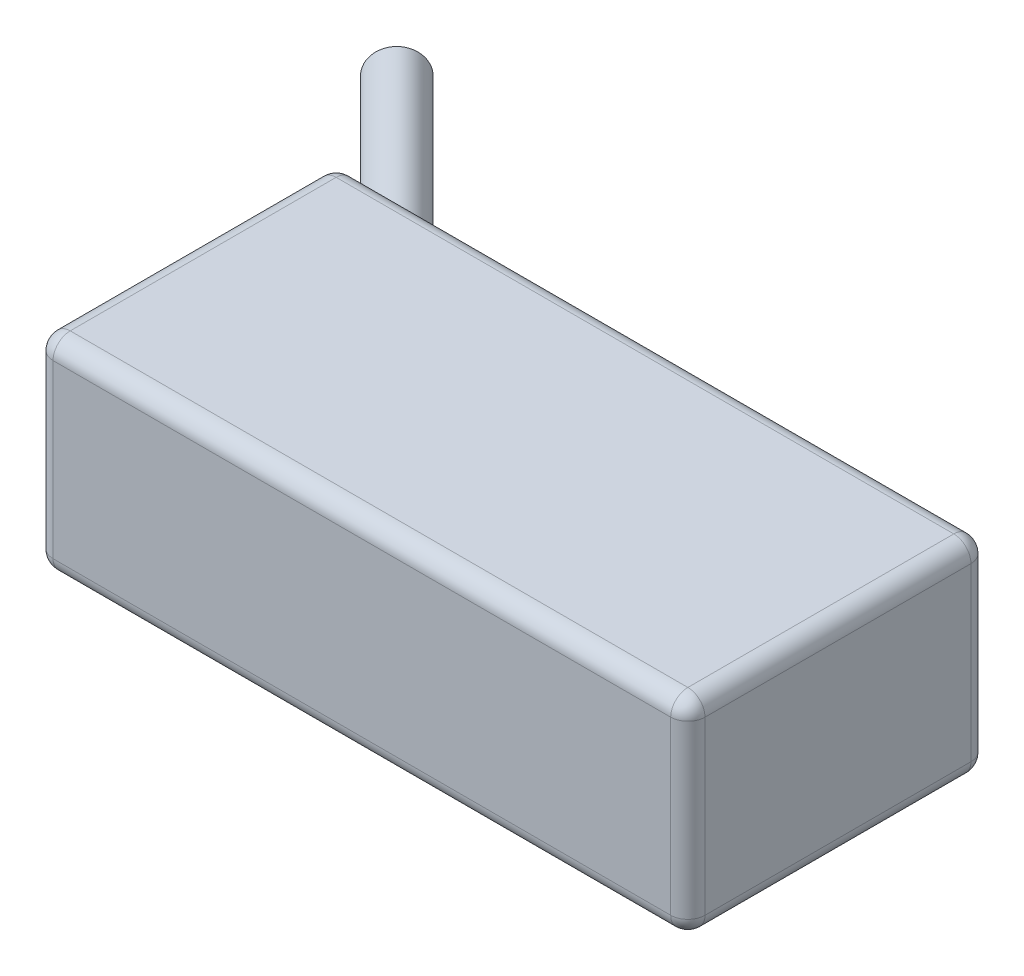
ISO-10303-21;
HEADER;
FILE_DESCRIPTION(('STEP AP214'),'2;1');
FILE_NAME('part.step','',(''),(''),'','','');
FILE_SCHEMA(('AUTOMOTIVE_DESIGN { 1 0 10303 214 1 1 1 1 }'));
ENDSEC;
DATA;
#1=APPLICATION_CONTEXT('core data for automotive mechanical design processes');
#2=APPLICATION_PROTOCOL_DEFINITION('international standard','automotive_design',2000,#1);
#3=PRODUCT_CONTEXT('',#1,'mechanical');
#4=PRODUCT('Part','Part','',(#3));
#5=PRODUCT_RELATED_PRODUCT_CATEGORY('part','',(#4));
#6=PRODUCT_DEFINITION_FORMATION('','',#4);
#7=PRODUCT_DEFINITION_CONTEXT('part definition',#1,'design');
#8=PRODUCT_DEFINITION('design','',#6,#7);
#9=PRODUCT_DEFINITION_SHAPE('','',#8);
#10=(LENGTH_UNIT() NAMED_UNIT(*) SI_UNIT(.MILLI.,.METRE.));
#11=(NAMED_UNIT(*) PLANE_ANGLE_UNIT() SI_UNIT($,.RADIAN.));
#12=(NAMED_UNIT(*) SI_UNIT($,.STERADIAN.) SOLID_ANGLE_UNIT());
#13=UNCERTAINTY_MEASURE_WITH_UNIT(LENGTH_MEASURE(1.E-05),#10,'distance_accuracy_value','');
#14=(GEOMETRIC_REPRESENTATION_CONTEXT(3) GLOBAL_UNCERTAINTY_ASSIGNED_CONTEXT((#13)) GLOBAL_UNIT_ASSIGNED_CONTEXT((#10,
#11,#12)) REPRESENTATION_CONTEXT('',''));
#15=CARTESIAN_POINT('',(0.,0.,0.));
#16=DIRECTION('',(0.,0.,1.));
#17=DIRECTION('',(1.,0.,0.));
#18=AXIS2_PLACEMENT_3D('',#15,#16,#17);
#19=CARTESIAN_POINT('',(38.,12.,-17.5));
#20=DIRECTION('',(-1.,0.,0.));
#21=DIRECTION('',(0.,0.,1.));
#22=AXIS2_PLACEMENT_3D('',#19,#20,#21);
#23=PLANE('',#22);
#24=DIRECTION('',(0.,-1.,0.));
#25=VECTOR('',#24,1.);
#26=CARTESIAN_POINT('',(38.,12.,15.5));
#27=LINE('',#26,#25);
#28=CARTESIAN_POINT('',(38.,10.,15.5));
#29=VERTEX_POINT('',#28);
#30=CARTESIAN_POINT('',(38.,-10.,15.5));
#31=VERTEX_POINT('',#30);
#32=EDGE_CURVE('E168',#29,#31,#27,.T.);
#33=ORIENTED_EDGE('',*,*,#32,.T.);
#34=DIRECTION('',(0.,0.,-1.));
#35=VECTOR('',#34,1.);
#36=CARTESIAN_POINT('',(38.,-10.,-17.5));
#37=LINE('',#36,#35);
#38=CARTESIAN_POINT('',(38.,-10.,-15.5));
#39=VERTEX_POINT('',#38);
#40=EDGE_CURVE('E173',#31,#39,#37,.T.);
#41=ORIENTED_EDGE('',*,*,#40,.T.);
#42=DIRECTION('',(0.,-1.,0.));
#43=VECTOR('',#42,1.);
#44=CARTESIAN_POINT('',(38.,12.,-15.5));
#45=LINE('',#44,#43);
#46=CARTESIAN_POINT('',(38.,10.,-15.5));
#47=VERTEX_POINT('',#46);
#48=EDGE_CURVE('E170',#39,#47,#45,.F.);
#49=ORIENTED_EDGE('',*,*,#48,.T.);
#50=DIRECTION('',(0.,0.,-1.));
#51=VECTOR('',#50,1.);
#52=CARTESIAN_POINT('',(38.,10.,17.5));
#53=LINE('',#52,#51);
#54=EDGE_CURVE('E166',#47,#29,#53,.F.);
#55=ORIENTED_EDGE('',*,*,#54,.T.);
#56=EDGE_LOOP('',(#33,#41,#49,#55));
#57=FACE_BOUND('',#56,.T.);
#58=ADVANCED_FACE('F39',(#57),#23,.F.);
#59=CARTESIAN_POINT('',(-38.,12.,-17.5));
#60=DIRECTION('',(0.,0.,1.));
#61=DIRECTION('',(1.,0.,0.));
#62=AXIS2_PLACEMENT_3D('',#59,#60,#61);
#63=PLANE('',#62);
#64=DIRECTION('',(0.,-1.,0.));
#65=VECTOR('',#64,1.);
#66=CARTESIAN_POINT('',(36.,12.,-17.5));
#67=LINE('',#66,#65);
#68=CARTESIAN_POINT('',(36.,10.,-17.5));
#69=VERTEX_POINT('',#68);
#70=CARTESIAN_POINT('',(36.,-10.,-17.5));
#71=VERTEX_POINT('',#70);
#72=EDGE_CURVE('E161',#69,#71,#67,.T.);
#73=ORIENTED_EDGE('',*,*,#72,.T.);
#74=DIRECTION('',(-1.,0.,0.));
#75=VECTOR('',#74,1.);
#76=CARTESIAN_POINT('',(-38.,-10.,-17.5));
#77=LINE('',#76,#75);
#78=CARTESIAN_POINT('',(-36.,-10.,-17.5));
#79=VERTEX_POINT('',#78);
#80=EDGE_CURVE('E164',#71,#79,#77,.T.);
#81=ORIENTED_EDGE('',*,*,#80,.T.);
#82=DIRECTION('',(0.,-1.,0.));
#83=VECTOR('',#82,1.);
#84=CARTESIAN_POINT('',(-36.,12.,-17.5));
#85=LINE('',#84,#83);
#86=CARTESIAN_POINT('',(-36.,10.,-17.5));
#87=VERTEX_POINT('',#86);
#88=EDGE_CURVE('E156',#79,#87,#85,.F.);
#89=ORIENTED_EDGE('',*,*,#88,.T.);
#90=DIRECTION('',(-1.,0.,0.));
#91=VECTOR('',#90,1.);
#92=CARTESIAN_POINT('',(38.,10.,-17.5));
#93=LINE('',#92,#91);
#94=EDGE_CURVE('E154',#87,#69,#93,.F.);
#95=ORIENTED_EDGE('',*,*,#94,.T.);
#96=EDGE_LOOP('',(#73,#81,#89,#95));
#97=FACE_BOUND('',#96,.T.);
#98=DIRECTION('',(0.,1.,0.));
#99=VECTOR('',#98,1.);
#100=CARTESIAN_POINT('',(-27.9999999999999,12.,-17.5));
#101=LINE('',#100,#99);
#102=CARTESIAN_POINT('',(-27.9999999999999,-6.17040966608938,-17.5));
#103=VERTEX_POINT('',#102);
#104=CARTESIAN_POINT('',(-27.9999999999999,-1.82959033391062,-17.5));
#105=VERTEX_POINT('',#104);
#106=EDGE_CURVE('E138',#103,#105,#101,.T.);
#107=ORIENTED_EDGE('',*,*,#106,.T.);
#108=CARTESIAN_POINT('',(-30.9289321881345,-4.,-17.5));
#109=DIRECTION('',(0.,0.,1.));
#110=DIRECTION('',(1.,0.,0.));
#111=AXIS2_PLACEMENT_3D('',#108,#109,#110);
#112=ELLIPSE('',#111,4.24264068711925,2.99999999999999);
#113=EDGE_CURVE('E145',#105,#103,#112,.T.);
#114=ORIENTED_EDGE('',*,*,#113,.T.);
#115=EDGE_LOOP('',(#107,#114));
#116=FACE_BOUND('',#115,.T.);
#117=DIRECTION('',(0.,1.,0.));
#118=VECTOR('',#117,1.);
#119=CARTESIAN_POINT('',(-27.9999999999999,12.,-17.5));
#120=LINE('',#119,#118);
#121=CARTESIAN_POINT('',(-27.9999999999999,1.8295903339106,-17.5));
#122=VERTEX_POINT('',#121);
#123=CARTESIAN_POINT('',(-27.9999999999999,6.1704096660894,-17.5));
#124=VERTEX_POINT('',#123);
#125=EDGE_CURVE('E569',#122,#124,#120,.T.);
#126=ORIENTED_EDGE('',*,*,#125,.T.);
#127=CARTESIAN_POINT('',(-30.9289321881345,4.,-17.5));
#128=DIRECTION('',(0.,0.,1.));
#129=DIRECTION('',(1.,0.,0.));
#130=AXIS2_PLACEMENT_3D('',#127,#128,#129);
#131=ELLIPSE('',#130,4.24264068711927,3.);
#132=EDGE_CURVE('E146',#124,#122,#131,.T.);
#133=ORIENTED_EDGE('',*,*,#132,.T.);
#134=EDGE_LOOP('',(#126,#133));
#135=FACE_BOUND('',#134,.T.);
#136=ADVANCED_FACE('F152',(#97,#116,#135),#63,.F.);
#137=CARTESIAN_POINT('',(-38.,12.,-17.5));
#138=DIRECTION('',(1.,0.,0.));
#139=DIRECTION('',(0.,0.,-1.));
#140=AXIS2_PLACEMENT_3D('',#137,#138,#139);
#141=PLANE('',#140);
#142=DIRECTION('',(0.,-1.,0.));
#143=VECTOR('',#142,1.);
#144=CARTESIAN_POINT('',(-38.,12.,-15.5));
#145=LINE('',#144,#143);
#146=CARTESIAN_POINT('',(-38.,10.,-15.5));
#147=VERTEX_POINT('',#146);
#148=CARTESIAN_POINT('',(-38.,-10.,-15.5));
#149=VERTEX_POINT('',#148);
#150=EDGE_CURVE('E179',#147,#149,#145,.T.);
#151=ORIENTED_EDGE('',*,*,#150,.T.);
#152=DIRECTION('',(0.,0.,1.));
#153=VECTOR('',#152,1.);
#154=CARTESIAN_POINT('',(-38.,-10.,-17.5));
#155=LINE('',#154,#153);
#156=CARTESIAN_POINT('',(-38.,-10.,15.5));
#157=VERTEX_POINT('',#156);
#158=EDGE_CURVE('E182',#149,#157,#155,.T.);
#159=ORIENTED_EDGE('',*,*,#158,.T.);
#160=DIRECTION('',(0.,-1.,0.));
#161=VECTOR('',#160,1.);
#162=CARTESIAN_POINT('',(-38.,12.,15.5));
#163=LINE('',#162,#161);
#164=CARTESIAN_POINT('',(-38.,10.,15.5));
#165=VERTEX_POINT('',#164);
#166=EDGE_CURVE('E177',#157,#165,#163,.F.);
#167=ORIENTED_EDGE('',*,*,#166,.T.);
#168=DIRECTION('',(0.,0.,1.));
#169=VECTOR('',#168,1.);
#170=CARTESIAN_POINT('',(-38.,10.,-17.5));
#171=LINE('',#170,#169);
#172=EDGE_CURVE('E175',#165,#147,#171,.F.);
#173=ORIENTED_EDGE('',*,*,#172,.T.);
#174=EDGE_LOOP('',(#151,#159,#167,#173));
#175=FACE_BOUND('',#174,.T.);
#176=ADVANCED_FACE('F321',(#175),#141,.F.);
#177=CARTESIAN_POINT('',(-38.,12.,17.5));
#178=DIRECTION('',(0.,0.,-1.));
#179=DIRECTION('',(-1.,0.,0.));
#180=AXIS2_PLACEMENT_3D('',#177,#178,#179);
#181=PLANE('',#180);
#182=DIRECTION('',(0.,-1.,0.));
#183=VECTOR('',#182,1.);
#184=CARTESIAN_POINT('',(-36.,12.,17.5));
#185=LINE('',#184,#183);
#186=CARTESIAN_POINT('',(-36.,10.,17.5));
#187=VERTEX_POINT('',#186);
#188=CARTESIAN_POINT('',(-36.,-10.,17.5));
#189=VERTEX_POINT('',#188);
#190=EDGE_CURVE('E188',#187,#189,#185,.T.);
#191=ORIENTED_EDGE('',*,*,#190,.T.);
#192=DIRECTION('',(1.,0.,0.));
#193=VECTOR('',#192,1.);
#194=CARTESIAN_POINT('',(-38.,-10.,17.5));
#195=LINE('',#194,#193);
#196=CARTESIAN_POINT('',(36.,-10.,17.5));
#197=VERTEX_POINT('',#196);
#198=EDGE_CURVE('E191',#189,#197,#195,.T.);
#199=ORIENTED_EDGE('',*,*,#198,.T.);
#200=DIRECTION('',(0.,-1.,0.));
#201=VECTOR('',#200,1.);
#202=CARTESIAN_POINT('',(36.,12.,17.5));
#203=LINE('',#202,#201);
#204=CARTESIAN_POINT('',(36.,10.,17.5));
#205=VERTEX_POINT('',#204);
#206=EDGE_CURVE('E186',#197,#205,#203,.F.);
#207=ORIENTED_EDGE('',*,*,#206,.T.);
#208=DIRECTION('',(1.,0.,0.));
#209=VECTOR('',#208,1.);
#210=CARTESIAN_POINT('',(-38.,10.,17.5));
#211=LINE('',#210,#209);
#212=EDGE_CURVE('E184',#205,#187,#211,.F.);
#213=ORIENTED_EDGE('',*,*,#212,.T.);
#214=EDGE_LOOP('',(#191,#199,#207,#213));
#215=FACE_BOUND('',#214,.T.);
#216=ADVANCED_FACE('F324',(#215),#181,.F.);
#217=CARTESIAN_POINT('',(0.,12.,0.));
#218=DIRECTION('',(0.,1.,0.));
#219=DIRECTION('',(0.,0.,1.));
#220=AXIS2_PLACEMENT_3D('',#217,#218,#219);
#221=PLANE('',#220);
#222=DIRECTION('',(0.,0.,1.));
#223=VECTOR('',#222,1.);
#224=CARTESIAN_POINT('',(-36.,12.,17.5));
#225=LINE('',#224,#223);
#226=CARTESIAN_POINT('',(-36.,12.,-15.5));
#227=VERTEX_POINT('',#226);
#228=CARTESIAN_POINT('',(-36.,12.,15.5));
#229=VERTEX_POINT('',#228);
#230=EDGE_CURVE('E48',#227,#229,#225,.T.);
#231=ORIENTED_EDGE('',*,*,#230,.T.);
#232=DIRECTION('',(1.,0.,0.));
#233=VECTOR('',#232,1.);
#234=CARTESIAN_POINT('',(38.,12.,15.5));
#235=LINE('',#234,#233);
#236=CARTESIAN_POINT('',(36.,12.,15.5));
#237=VERTEX_POINT('',#236);
#238=EDGE_CURVE('E11',#229,#237,#235,.T.);
#239=ORIENTED_EDGE('',*,*,#238,.T.);
#240=DIRECTION('',(0.,0.,-1.));
#241=VECTOR('',#240,1.);
#242=CARTESIAN_POINT('',(36.,12.,-17.5));
#243=LINE('',#242,#241);
#244=CARTESIAN_POINT('',(36.,12.,-15.5));
#245=VERTEX_POINT('',#244);
#246=EDGE_CURVE('E202',#237,#245,#243,.T.);
#247=ORIENTED_EDGE('',*,*,#246,.T.);
#248=DIRECTION('',(-1.,0.,0.));
#249=VECTOR('',#248,1.);
#250=CARTESIAN_POINT('',(-38.,12.,-15.5));
#251=LINE('',#250,#249);
#252=EDGE_CURVE('E59',#245,#227,#251,.T.);
#253=ORIENTED_EDGE('',*,*,#252,.T.);
#254=EDGE_LOOP('',(#231,#239,#247,#253));
#255=FACE_BOUND('',#254,.T.);
#256=ADVANCED_FACE('F288',(#255),#221,.T.);
#257=CARTESIAN_POINT('',(0.,-12.,0.));
#258=DIRECTION('',(0.,1.,0.));
#259=DIRECTION('',(0.,0.,1.));
#260=AXIS2_PLACEMENT_3D('',#257,#258,#259);
#261=PLANE('',#260);
#262=DIRECTION('',(0.,0.,1.));
#263=VECTOR('',#262,1.);
#264=CARTESIAN_POINT('',(-36.,-12.,0.));
#265=LINE('',#264,#263);
#266=CARTESIAN_POINT('',(-36.,-12.,15.5));
#267=VERTEX_POINT('',#266);
#268=CARTESIAN_POINT('',(-36.,-12.,-15.5));
#269=VERTEX_POINT('',#268);
#270=EDGE_CURVE('E197',#267,#269,#265,.F.);
#271=ORIENTED_EDGE('',*,*,#270,.T.);
#272=DIRECTION('',(-1.,0.,0.));
#273=VECTOR('',#272,1.);
#274=CARTESIAN_POINT('',(0.,-12.,-15.5));
#275=LINE('',#274,#273);
#276=CARTESIAN_POINT('',(36.,-12.,-15.5));
#277=VERTEX_POINT('',#276);
#278=EDGE_CURVE('E199',#269,#277,#275,.F.);
#279=ORIENTED_EDGE('',*,*,#278,.T.);
#280=DIRECTION('',(0.,0.,-1.));
#281=VECTOR('',#280,1.);
#282=CARTESIAN_POINT('',(36.,-12.,0.));
#283=LINE('',#282,#281);
#284=CARTESIAN_POINT('',(36.,-12.,15.5));
#285=VERTEX_POINT('',#284);
#286=EDGE_CURVE('E193',#277,#285,#283,.F.);
#287=ORIENTED_EDGE('',*,*,#286,.T.);
#288=DIRECTION('',(1.,0.,0.));
#289=VECTOR('',#288,1.);
#290=CARTESIAN_POINT('',(0.,-12.,15.5));
#291=LINE('',#290,#289);
#292=EDGE_CURVE('E195',#285,#267,#291,.F.);
#293=ORIENTED_EDGE('',*,*,#292,.T.);
#294=EDGE_LOOP('',(#271,#279,#287,#293));
#295=FACE_BOUND('',#294,.T.);
#296=ADVANCED_FACE('F527',(#295),#261,.F.);
#297=CARTESIAN_POINT('',(-50.6776695296635,4.,-37.2487373415292));
#298=DIRECTION('',(0.707106781186544,0.,0.707106781186551));
#299=DIRECTION('',(0.707106781186551,0.,-0.707106781186544));
#300=AXIS2_PLACEMENT_3D('',#297,#298,#299);
#301=CYLINDRICAL_SURFACE('',#300,3.);
#302=CARTESIAN_POINT('',(-50.6776695296635,4.,-37.2487373415292));
#303=DIRECTION('',(0.707106781186544,0.,0.707106781186551));
#304=DIRECTION('',(0.707106781186551,0.,-0.707106781186544));
#305=AXIS2_PLACEMENT_3D('',#302,#303,#304);
#306=CIRCLE('',#305,3.);
#307=CARTESIAN_POINT('',(-48.5563491861039,4.,-39.3700576850888));
#308=VERTEX_POINT('',#307);
#309=EDGE_CURVE('E563',#308,#308,#306,.T.);
#310=ORIENTED_EDGE('',*,*,#309,.T.);
#311=EDGE_LOOP('',(#310));
#312=FACE_BOUND('',#311,.T.);
#313=ORIENTED_EDGE('',*,*,#132,.F.);
#314=CARTESIAN_POINT('',(-29.4644660940672,4.,-16.0355339059326));
#315=DIRECTION('',(0.707106781186544,0.,0.707106781186551));
#316=DIRECTION('',(0.707106781186551,0.,-0.707106781186544));
#317=AXIS2_PLACEMENT_3D('',#314,#315,#316);
#318=CIRCLE('',#317,3.);
#319=EDGE_CURVE('E568',#122,#124,#318,.T.);
#320=ORIENTED_EDGE('',*,*,#319,.F.);
#321=EDGE_LOOP('',(#313,#320));
#322=FACE_BOUND('',#321,.T.);
#323=ADVANCED_FACE('F519',(#312,#322),#301,.T.);
#324=CARTESIAN_POINT('',(-29.4644660940672,4.,-16.0355339059326));
#325=DIRECTION('',(0.707106781186544,0.,0.707106781186551));
#326=DIRECTION('',(0.707106781186551,0.,-0.707106781186544));
#327=AXIS2_PLACEMENT_3D('',#324,#325,#326);
#328=PLANE('',#327);
#329=ORIENTED_EDGE('',*,*,#125,.F.);
#330=ORIENTED_EDGE('',*,*,#319,.T.);
#331=EDGE_LOOP('',(#329,#330));
#332=FACE_BOUND('',#331,.T.);
#333=ADVANCED_FACE('F511',(#332),#328,.T.);
#334=CARTESIAN_POINT('',(-50.6776695296635,4.,-37.2487373415292));
#335=DIRECTION('',(0.707106781186544,0.,0.707106781186551));
#336=DIRECTION('',(0.707106781186551,0.,-0.707106781186544));
#337=AXIS2_PLACEMENT_3D('',#334,#335,#336);
#338=PLANE('',#337);
#339=ORIENTED_EDGE('',*,*,#309,.F.);
#340=EDGE_LOOP('',(#339));
#341=FACE_BOUND('',#340,.T.);
#342=ADVANCED_FACE('F503',(#341),#338,.F.);
#343=CARTESIAN_POINT('',(-50.6776695296635,-4.,-37.2487373415292));
#344=DIRECTION('',(0.707106781186544,0.,0.707106781186551));
#345=DIRECTION('',(0.707106781186551,0.,-0.707106781186544));
#346=AXIS2_PLACEMENT_3D('',#343,#344,#345);
#347=CYLINDRICAL_SURFACE('',#346,2.99999999999999);
#348=CARTESIAN_POINT('',(-50.6776695296635,-4.,-37.2487373415292));
#349=DIRECTION('',(0.707106781186544,0.,0.707106781186551));
#350=DIRECTION('',(0.707106781186551,0.,-0.707106781186544));
#351=AXIS2_PLACEMENT_3D('',#348,#349,#350);
#352=CIRCLE('',#351,2.99999999999999);
#353=CARTESIAN_POINT('',(-48.5563491861039,-4.,-39.3700576850888));
#354=VERTEX_POINT('',#353);
#355=EDGE_CURVE('E150',#354,#354,#352,.T.);
#356=ORIENTED_EDGE('',*,*,#355,.T.);
#357=EDGE_LOOP('',(#356));
#358=FACE_BOUND('',#357,.T.);
#359=ORIENTED_EDGE('',*,*,#113,.F.);
#360=CARTESIAN_POINT('',(-29.4644660940672,-4.,-16.0355339059326));
#361=DIRECTION('',(0.707106781186544,0.,0.707106781186551));
#362=DIRECTION('',(0.707106781186551,0.,-0.707106781186544));
#363=AXIS2_PLACEMENT_3D('',#360,#361,#362);
#364=CIRCLE('',#363,2.99999999999999);
#365=EDGE_CURVE('E141',#103,#105,#364,.T.);
#366=ORIENTED_EDGE('',*,*,#365,.F.);
#367=EDGE_LOOP('',(#359,#366));
#368=FACE_BOUND('',#367,.T.);
#369=ADVANCED_FACE('F149',(#358,#368),#347,.T.);
#370=CARTESIAN_POINT('',(-29.4644660940672,-4.,-16.0355339059326));
#371=DIRECTION('',(0.707106781186544,0.,0.707106781186551));
#372=DIRECTION('',(0.707106781186551,0.,-0.707106781186544));
#373=AXIS2_PLACEMENT_3D('',#370,#371,#372);
#374=PLANE('',#373);
#375=ORIENTED_EDGE('',*,*,#106,.F.);
#376=ORIENTED_EDGE('',*,*,#365,.T.);
#377=EDGE_LOOP('',(#375,#376));
#378=FACE_BOUND('',#377,.T.);
#379=ADVANCED_FACE('F140',(#378),#374,.T.);
#380=CARTESIAN_POINT('',(-50.6776695296635,-4.,-37.2487373415292));
#381=DIRECTION('',(0.707106781186544,0.,0.707106781186551));
#382=DIRECTION('',(0.707106781186551,0.,-0.707106781186544));
#383=AXIS2_PLACEMENT_3D('',#380,#381,#382);
#384=PLANE('',#383);
#385=ORIENTED_EDGE('',*,*,#355,.F.);
#386=EDGE_LOOP('',(#385));
#387=FACE_BOUND('',#386,.T.);
#388=ADVANCED_FACE('F484',(#387),#384,.F.);
#389=CARTESIAN_POINT('',(-36.,12.,15.5));
#390=DIRECTION('',(0.,-1.,0.));
#391=DIRECTION('',(0.,0.,-1.));
#392=AXIS2_PLACEMENT_3D('',#389,#390,#391);
#393=CYLINDRICAL_SURFACE('',#392,2.);
#394=CARTESIAN_POINT('',(-36.,10.,15.5));
#395=DIRECTION('',(0.,1.,0.));
#396=DIRECTION('',(0.,0.,1.));
#397=AXIS2_PLACEMENT_3D('',#394,#395,#396);
#398=CIRCLE('',#397,2.);
#399=EDGE_CURVE('E43',#165,#187,#398,.T.);
#400=ORIENTED_EDGE('',*,*,#399,.F.);
#401=ORIENTED_EDGE('',*,*,#166,.F.);
#402=CARTESIAN_POINT('',(-36.,-10.,15.5));
#403=DIRECTION('',(0.,-1.,0.));
#404=DIRECTION('',(0.,0.,-1.));
#405=AXIS2_PLACEMENT_3D('',#402,#403,#404);
#406=CIRCLE('',#405,2.);
#407=EDGE_CURVE('E266',#189,#157,#406,.T.);
#408=ORIENTED_EDGE('',*,*,#407,.F.);
#409=ORIENTED_EDGE('',*,*,#190,.F.);
#410=EDGE_LOOP('',(#400,#401,#408,#409));
#411=FACE_BOUND('',#410,.T.);
#412=ADVANCED_FACE('F41',(#411),#393,.T.);
#413=CARTESIAN_POINT('',(-36.,10.,15.5));
#414=DIRECTION('',(0.,0.,1.));
#415=DIRECTION('',(1.,0.,0.));
#416=AXIS2_PLACEMENT_3D('',#413,#414,#415);
#417=SPHERICAL_SURFACE('',#416,2.);
#418=CARTESIAN_POINT('',(-36.,10.,15.5));
#419=DIRECTION('',(0.,0.,1.));
#420=DIRECTION('',(1.,0.,0.));
#421=AXIS2_PLACEMENT_3D('',#418,#419,#420);
#422=CIRCLE('',#421,2.);
#423=EDGE_CURVE('E262',#165,#229,#422,.F.);
#424=ORIENTED_EDGE('',*,*,#423,.F.);
#425=ORIENTED_EDGE('',*,*,#399,.T.);
#426=CARTESIAN_POINT('',(-36.,10.,15.5));
#427=DIRECTION('',(-1.,0.,0.));
#428=DIRECTION('',(0.,0.,1.));
#429=AXIS2_PLACEMENT_3D('',#426,#427,#428);
#430=CIRCLE('',#429,2.);
#431=EDGE_CURVE('E264',#229,#187,#430,.F.);
#432=ORIENTED_EDGE('',*,*,#431,.F.);
#433=EDGE_LOOP('',(#424,#425,#432));
#434=FACE_BOUND('',#433,.T.);
#435=ADVANCED_FACE('F277',(#434),#417,.T.);
#436=CARTESIAN_POINT('',(-36.,-10.,15.5));
#437=DIRECTION('',(-1.,0.,0.));
#438=DIRECTION('',(0.,-1.,0.));
#439=AXIS2_PLACEMENT_3D('',#436,#437,#438);
#440=SPHERICAL_SURFACE('',#439,2.);
#441=CARTESIAN_POINT('',(-36.,-10.,15.5));
#442=DIRECTION('',(-1.,0.,0.));
#443=DIRECTION('',(0.,0.,1.));
#444=AXIS2_PLACEMENT_3D('',#441,#442,#443);
#445=CIRCLE('',#444,2.);
#446=EDGE_CURVE('E256',#189,#267,#445,.F.);
#447=ORIENTED_EDGE('',*,*,#446,.F.);
#448=ORIENTED_EDGE('',*,*,#407,.T.);
#449=CARTESIAN_POINT('',(-36.,-10.,15.5));
#450=DIRECTION('',(0.,0.,1.));
#451=DIRECTION('',(1.,0.,0.));
#452=AXIS2_PLACEMENT_3D('',#449,#450,#451);
#453=CIRCLE('',#452,2.);
#454=EDGE_CURVE('E259',#267,#157,#453,.F.);
#455=ORIENTED_EDGE('',*,*,#454,.F.);
#456=EDGE_LOOP('',(#447,#448,#455));
#457=FACE_BOUND('',#456,.T.);
#458=ADVANCED_FACE('F393',(#457),#440,.T.);
#459=CARTESIAN_POINT('',(0.,10.,15.5));
#460=DIRECTION('',(-1.,0.,0.));
#461=DIRECTION('',(0.,0.,1.));
#462=AXIS2_PLACEMENT_3D('',#459,#460,#461);
#463=CYLINDRICAL_SURFACE('',#462,2.);
#464=ORIENTED_EDGE('',*,*,#431,.T.);
#465=ORIENTED_EDGE('',*,*,#212,.F.);
#466=CARTESIAN_POINT('',(36.,10.,15.5));
#467=DIRECTION('',(1.,0.,0.));
#468=DIRECTION('',(0.,0.,-1.));
#469=AXIS2_PLACEMENT_3D('',#466,#467,#468);
#470=CIRCLE('',#469,2.);
#471=EDGE_CURVE('E250',#237,#205,#470,.T.);
#472=ORIENTED_EDGE('',*,*,#471,.F.);
#473=ORIENTED_EDGE('',*,*,#238,.F.);
#474=EDGE_LOOP('',(#464,#465,#472,#473));
#475=FACE_BOUND('',#474,.T.);
#476=ADVANCED_FACE('F285',(#475),#463,.T.);
#477=CARTESIAN_POINT('',(-36.,10.,0.));
#478=DIRECTION('',(0.,0.,-1.));
#479=DIRECTION('',(-1.,0.,0.));
#480=AXIS2_PLACEMENT_3D('',#477,#478,#479);
#481=CYLINDRICAL_SURFACE('',#480,2.);
#482=ORIENTED_EDGE('',*,*,#423,.T.);
#483=ORIENTED_EDGE('',*,*,#230,.F.);
#484=CARTESIAN_POINT('',(-36.,10.,-15.5));
#485=DIRECTION('',(0.,0.,-1.));
#486=DIRECTION('',(-1.,0.,0.));
#487=AXIS2_PLACEMENT_3D('',#484,#485,#486);
#488=CIRCLE('',#487,2.);
#489=EDGE_CURVE('E247',#147,#227,#488,.T.);
#490=ORIENTED_EDGE('',*,*,#489,.F.);
#491=ORIENTED_EDGE('',*,*,#172,.F.);
#492=EDGE_LOOP('',(#482,#483,#490,#491));
#493=FACE_BOUND('',#492,.T.);
#494=ADVANCED_FACE('F319',(#493),#481,.T.);
#495=CARTESIAN_POINT('',(-36.,12.,-15.5));
#496=DIRECTION('',(0.,-1.,0.));
#497=DIRECTION('',(0.,0.,-1.));
#498=AXIS2_PLACEMENT_3D('',#495,#496,#497);
#499=CYLINDRICAL_SURFACE('',#498,2.);
#500=CARTESIAN_POINT('',(-36.,-10.,-15.5));
#501=DIRECTION('',(0.,-1.,0.));
#502=DIRECTION('',(0.,0.,-1.));
#503=AXIS2_PLACEMENT_3D('',#500,#501,#502);
#504=CIRCLE('',#503,2.);
#505=EDGE_CURVE('E241',#149,#79,#504,.T.);
#506=ORIENTED_EDGE('',*,*,#505,.F.);
#507=ORIENTED_EDGE('',*,*,#150,.F.);
#508=CARTESIAN_POINT('',(-36.,10.,-15.5));
#509=DIRECTION('',(0.,1.,0.));
#510=DIRECTION('',(0.,0.,1.));
#511=AXIS2_PLACEMENT_3D('',#508,#509,#510);
#512=CIRCLE('',#511,2.);
#513=EDGE_CURVE('E244',#87,#147,#512,.T.);
#514=ORIENTED_EDGE('',*,*,#513,.F.);
#515=ORIENTED_EDGE('',*,*,#88,.F.);
#516=EDGE_LOOP('',(#506,#507,#514,#515));
#517=FACE_BOUND('',#516,.T.);
#518=ADVANCED_FACE('F314',(#517),#499,.T.);
#519=CARTESIAN_POINT('',(-36.,-10.,-17.5));
#520=DIRECTION('',(0.,0.,1.));
#521=DIRECTION('',(1.,0.,0.));
#522=AXIS2_PLACEMENT_3D('',#519,#520,#521);
#523=CYLINDRICAL_SURFACE('',#522,2.);
#524=ORIENTED_EDGE('',*,*,#454,.T.);
#525=ORIENTED_EDGE('',*,*,#158,.F.);
#526=CARTESIAN_POINT('',(-36.,-10.,-15.5));
#527=DIRECTION('',(0.,0.,-1.));
#528=DIRECTION('',(-1.,0.,0.));
#529=AXIS2_PLACEMENT_3D('',#526,#527,#528);
#530=CIRCLE('',#529,2.);
#531=EDGE_CURVE('E239',#269,#149,#530,.T.);
#532=ORIENTED_EDGE('',*,*,#531,.F.);
#533=ORIENTED_EDGE('',*,*,#270,.F.);
#534=EDGE_LOOP('',(#524,#525,#532,#533));
#535=FACE_BOUND('',#534,.T.);
#536=ADVANCED_FACE('F392',(#535),#523,.T.);
#537=CARTESIAN_POINT('',(-38.,-10.,15.5));
#538=DIRECTION('',(1.,0.,0.));
#539=DIRECTION('',(0.,0.,-1.));
#540=AXIS2_PLACEMENT_3D('',#537,#538,#539);
#541=CYLINDRICAL_SURFACE('',#540,2.);
#542=ORIENTED_EDGE('',*,*,#446,.T.);
#543=ORIENTED_EDGE('',*,*,#292,.F.);
#544=CARTESIAN_POINT('',(36.,-10.,15.5));
#545=DIRECTION('',(1.,0.,0.));
#546=DIRECTION('',(0.,0.,-1.));
#547=AXIS2_PLACEMENT_3D('',#544,#545,#546);
#548=CIRCLE('',#547,2.);
#549=EDGE_CURVE('E236',#197,#285,#548,.T.);
#550=ORIENTED_EDGE('',*,*,#549,.F.);
#551=ORIENTED_EDGE('',*,*,#198,.F.);
#552=EDGE_LOOP('',(#542,#543,#550,#551));
#553=FACE_BOUND('',#552,.T.);
#554=ADVANCED_FACE('F334',(#553),#541,.T.);
#555=CARTESIAN_POINT('',(36.,12.,15.5));
#556=DIRECTION('',(0.,-1.,0.));
#557=DIRECTION('',(0.,0.,-1.));
#558=AXIS2_PLACEMENT_3D('',#555,#556,#557);
#559=CYLINDRICAL_SURFACE('',#558,2.);
#560=CARTESIAN_POINT('',(36.,10.,15.5));
#561=DIRECTION('',(0.,1.,0.));
#562=DIRECTION('',(0.,0.,1.));
#563=AXIS2_PLACEMENT_3D('',#560,#561,#562);
#564=CIRCLE('',#563,2.);
#565=EDGE_CURVE('E253',#205,#29,#564,.T.);
#566=ORIENTED_EDGE('',*,*,#565,.F.);
#567=ORIENTED_EDGE('',*,*,#206,.F.);
#568=CARTESIAN_POINT('',(36.,-10.,15.5));
#569=DIRECTION('',(0.,-1.,0.));
#570=DIRECTION('',(0.,0.,-1.));
#571=AXIS2_PLACEMENT_3D('',#568,#569,#570);
#572=CIRCLE('',#571,2.);
#573=EDGE_CURVE('E233',#31,#197,#572,.T.);
#574=ORIENTED_EDGE('',*,*,#573,.F.);
#575=ORIENTED_EDGE('',*,*,#32,.F.);
#576=EDGE_LOOP('',(#566,#567,#574,#575));
#577=FACE_BOUND('',#576,.T.);
#578=ADVANCED_FACE('F329',(#577),#559,.T.);
#579=CARTESIAN_POINT('',(36.,10.,15.5));
#580=DIRECTION('',(0.,0.,1.));
#581=DIRECTION('',(1.,0.,0.));
#582=AXIS2_PLACEMENT_3D('',#579,#580,#581);
#583=SPHERICAL_SURFACE('',#582,2.);
#584=ORIENTED_EDGE('',*,*,#471,.T.);
#585=ORIENTED_EDGE('',*,*,#565,.T.);
#586=CARTESIAN_POINT('',(36.,10.,15.5));
#587=DIRECTION('',(0.,0.,1.));
#588=DIRECTION('',(0.,-1.,0.));
#589=AXIS2_PLACEMENT_3D('',#586,#587,#588);
#590=CIRCLE('',#589,2.);
#591=EDGE_CURVE('E230',#237,#29,#590,.F.);
#592=ORIENTED_EDGE('',*,*,#591,.F.);
#593=EDGE_LOOP('',(#584,#585,#592));
#594=FACE_BOUND('',#593,.T.);
#595=ADVANCED_FACE('F344',(#594),#583,.T.);
#596=CARTESIAN_POINT('',(-36.,10.,-15.5));
#597=DIRECTION('',(-1.,0.,0.));
#598=DIRECTION('',(0.,0.,1.));
#599=AXIS2_PLACEMENT_3D('',#596,#597,#598);
#600=SPHERICAL_SURFACE('',#599,2.);
#601=ORIENTED_EDGE('',*,*,#513,.T.);
#602=ORIENTED_EDGE('',*,*,#489,.T.);
#603=CARTESIAN_POINT('',(-36.,10.,-15.5));
#604=DIRECTION('',(-1.,0.,0.));
#605=DIRECTION('',(0.,0.,1.));
#606=AXIS2_PLACEMENT_3D('',#603,#604,#605);
#607=CIRCLE('',#606,2.);
#608=EDGE_CURVE('E227',#87,#227,#607,.F.);
#609=ORIENTED_EDGE('',*,*,#608,.F.);
#610=EDGE_LOOP('',(#601,#602,#609));
#611=FACE_BOUND('',#610,.T.);
#612=ADVANCED_FACE('F317',(#611),#600,.T.);
#613=CARTESIAN_POINT('',(-36.,-10.,-15.5));
#614=DIRECTION('',(-1.,0.,0.));
#615=DIRECTION('',(0.,-1.,0.));
#616=AXIS2_PLACEMENT_3D('',#613,#614,#615);
#617=SPHERICAL_SURFACE('',#616,2.);
#618=ORIENTED_EDGE('',*,*,#531,.T.);
#619=ORIENTED_EDGE('',*,*,#505,.T.);
#620=CARTESIAN_POINT('',(-36.,-10.,-15.5));
#621=DIRECTION('',(-1.,0.,0.));
#622=DIRECTION('',(0.,0.,1.));
#623=AXIS2_PLACEMENT_3D('',#620,#621,#622);
#624=CIRCLE('',#623,2.);
#625=EDGE_CURVE('E224',#269,#79,#624,.F.);
#626=ORIENTED_EDGE('',*,*,#625,.F.);
#627=EDGE_LOOP('',(#618,#619,#626));
#628=FACE_BOUND('',#627,.T.);
#629=ADVANCED_FACE('F351',(#628),#617,.T.);
#630=CARTESIAN_POINT('',(36.,-10.,15.5));
#631=DIRECTION('',(0.,0.,1.));
#632=DIRECTION('',(0.,-1.,0.));
#633=AXIS2_PLACEMENT_3D('',#630,#631,#632);
#634=SPHERICAL_SURFACE('',#633,2.);
#635=ORIENTED_EDGE('',*,*,#573,.T.);
#636=ORIENTED_EDGE('',*,*,#549,.T.);
#637=CARTESIAN_POINT('',(36.,-10.,15.5));
#638=DIRECTION('',(0.,0.,1.));
#639=DIRECTION('',(1.,0.,0.));
#640=AXIS2_PLACEMENT_3D('',#637,#638,#639);
#641=CIRCLE('',#640,2.);
#642=EDGE_CURVE('E221',#31,#285,#641,.F.);
#643=ORIENTED_EDGE('',*,*,#642,.F.);
#644=EDGE_LOOP('',(#635,#636,#643));
#645=FACE_BOUND('',#644,.T.);
#646=ADVANCED_FACE('F336',(#645),#634,.T.);
#647=CARTESIAN_POINT('',(36.,10.,0.));
#648=DIRECTION('',(0.,0.,1.));
#649=DIRECTION('',(1.,0.,0.));
#650=AXIS2_PLACEMENT_3D('',#647,#648,#649);
#651=CYLINDRICAL_SURFACE('',#650,2.);
#652=ORIENTED_EDGE('',*,*,#591,.T.);
#653=ORIENTED_EDGE('',*,*,#54,.F.);
#654=CARTESIAN_POINT('',(36.,10.,-15.5));
#655=DIRECTION('',(0.,0.,-1.));
#656=DIRECTION('',(-1.,0.,0.));
#657=AXIS2_PLACEMENT_3D('',#654,#655,#656);
#658=CIRCLE('',#657,2.);
#659=EDGE_CURVE('E218',#245,#47,#658,.T.);
#660=ORIENTED_EDGE('',*,*,#659,.F.);
#661=ORIENTED_EDGE('',*,*,#246,.F.);
#662=EDGE_LOOP('',(#652,#653,#660,#661));
#663=FACE_BOUND('',#662,.T.);
#664=ADVANCED_FACE('F299',(#663),#651,.T.);
#665=CARTESIAN_POINT('',(0.,10.,-15.5));
#666=DIRECTION('',(1.,0.,0.));
#667=DIRECTION('',(0.,0.,-1.));
#668=AXIS2_PLACEMENT_3D('',#665,#666,#667);
#669=CYLINDRICAL_SURFACE('',#668,2.);
#670=ORIENTED_EDGE('',*,*,#608,.T.);
#671=ORIENTED_EDGE('',*,*,#252,.F.);
#672=CARTESIAN_POINT('',(36.,10.,-15.5));
#673=DIRECTION('',(1.,0.,0.));
#674=DIRECTION('',(0.,0.,-1.));
#675=AXIS2_PLACEMENT_3D('',#672,#673,#674);
#676=CIRCLE('',#675,2.);
#677=EDGE_CURVE('E215',#69,#245,#676,.T.);
#678=ORIENTED_EDGE('',*,*,#677,.F.);
#679=ORIENTED_EDGE('',*,*,#94,.F.);
#680=EDGE_LOOP('',(#670,#671,#678,#679));
#681=FACE_BOUND('',#680,.T.);
#682=ADVANCED_FACE('F294',(#681),#669,.T.);
#683=CARTESIAN_POINT('',(-38.,-10.,-15.5));
#684=DIRECTION('',(-1.,0.,0.));
#685=DIRECTION('',(0.,0.,1.));
#686=AXIS2_PLACEMENT_3D('',#683,#684,#685);
#687=CYLINDRICAL_SURFACE('',#686,2.);
#688=ORIENTED_EDGE('',*,*,#625,.T.);
#689=ORIENTED_EDGE('',*,*,#80,.F.);
#690=CARTESIAN_POINT('',(36.,-10.,-15.5));
#691=DIRECTION('',(1.,0.,0.));
#692=DIRECTION('',(0.,0.,-1.));
#693=AXIS2_PLACEMENT_3D('',#690,#691,#692);
#694=CIRCLE('',#693,2.);
#695=EDGE_CURVE('E212',#277,#71,#694,.T.);
#696=ORIENTED_EDGE('',*,*,#695,.F.);
#697=ORIENTED_EDGE('',*,*,#278,.F.);
#698=EDGE_LOOP('',(#688,#689,#696,#697));
#699=FACE_BOUND('',#698,.T.);
#700=ADVANCED_FACE('F373',(#699),#687,.T.);
#701=CARTESIAN_POINT('',(36.,-10.,-17.5));
#702=DIRECTION('',(0.,0.,-1.));
#703=DIRECTION('',(-1.,0.,0.));
#704=AXIS2_PLACEMENT_3D('',#701,#702,#703);
#705=CYLINDRICAL_SURFACE('',#704,2.);
#706=ORIENTED_EDGE('',*,*,#642,.T.);
#707=ORIENTED_EDGE('',*,*,#286,.F.);
#708=CARTESIAN_POINT('',(36.,-10.,-15.5));
#709=DIRECTION('',(0.,0.,-1.));
#710=DIRECTION('',(-1.,0.,0.));
#711=AXIS2_PLACEMENT_3D('',#708,#709,#710);
#712=CIRCLE('',#711,2.);
#713=EDGE_CURVE('E210',#39,#277,#712,.T.);
#714=ORIENTED_EDGE('',*,*,#713,.F.);
#715=ORIENTED_EDGE('',*,*,#40,.F.);
#716=EDGE_LOOP('',(#706,#707,#714,#715));
#717=FACE_BOUND('',#716,.T.);
#718=ADVANCED_FACE('F341',(#717),#705,.T.);
#719=CARTESIAN_POINT('',(36.,10.,-15.5));
#720=DIRECTION('',(0.,1.,0.));
#721=DIRECTION('',(0.,0.,1.));
#722=AXIS2_PLACEMENT_3D('',#719,#720,#721);
#723=SPHERICAL_SURFACE('',#722,2.);
#724=ORIENTED_EDGE('',*,*,#677,.T.);
#725=ORIENTED_EDGE('',*,*,#659,.T.);
#726=CARTESIAN_POINT('',(36.,10.,-15.5));
#727=DIRECTION('',(0.,1.,0.));
#728=DIRECTION('',(0.,0.,1.));
#729=AXIS2_PLACEMENT_3D('',#726,#727,#728);
#730=CIRCLE('',#729,2.);
#731=EDGE_CURVE('E208',#69,#47,#730,.F.);
#732=ORIENTED_EDGE('',*,*,#731,.F.);
#733=EDGE_LOOP('',(#724,#725,#732));
#734=FACE_BOUND('',#733,.T.);
#735=ADVANCED_FACE('F301',(#734),#723,.T.);
#736=CARTESIAN_POINT('',(36.,-10.,-15.5));
#737=DIRECTION('',(0.,-1.,0.));
#738=DIRECTION('',(0.,0.,-1.));
#739=AXIS2_PLACEMENT_3D('',#736,#737,#738);
#740=SPHERICAL_SURFACE('',#739,2.);
#741=ORIENTED_EDGE('',*,*,#713,.T.);
#742=ORIENTED_EDGE('',*,*,#695,.T.);
#743=CARTESIAN_POINT('',(36.,-10.,-15.5));
#744=DIRECTION('',(0.,-1.,0.));
#745=DIRECTION('',(0.,0.,-1.));
#746=AXIS2_PLACEMENT_3D('',#743,#744,#745);
#747=CIRCLE('',#746,2.);
#748=EDGE_CURVE('E206',#39,#71,#747,.F.);
#749=ORIENTED_EDGE('',*,*,#748,.F.);
#750=EDGE_LOOP('',(#741,#742,#749));
#751=FACE_BOUND('',#750,.T.);
#752=ADVANCED_FACE('F365',(#751),#740,.T.);
#753=CARTESIAN_POINT('',(36.,12.,-15.5));
#754=DIRECTION('',(0.,-1.,0.));
#755=DIRECTION('',(0.,0.,-1.));
#756=AXIS2_PLACEMENT_3D('',#753,#754,#755);
#757=CYLINDRICAL_SURFACE('',#756,2.);
#758=ORIENTED_EDGE('',*,*,#731,.T.);
#759=ORIENTED_EDGE('',*,*,#48,.F.);
#760=ORIENTED_EDGE('',*,*,#748,.T.);
#761=ORIENTED_EDGE('',*,*,#72,.F.);
#762=EDGE_LOOP('',(#758,#759,#760,#761));
#763=FACE_BOUND('',#762,.T.);
#764=ADVANCED_FACE('F305',(#763),#757,.T.);
#765=CLOSED_SHELL('',(#58,#136,#176,#216,#256,#296,#323,#333,#342,#369,#379,#388,#412,#435,#458,
#476,#494,#518,#536,#554,#578,#595,#612,#629,#646,#664,#682,#700,#718,#735,#752,#764));
#766=MANIFOLD_SOLID_BREP('B2',#765);
#767=ADVANCED_BREP_SHAPE_REPRESENTATION('',(#18,#766),#14);
#768=SHAPE_DEFINITION_REPRESENTATION(#9,#767);
ENDSEC;
END-ISO-10303-21;
